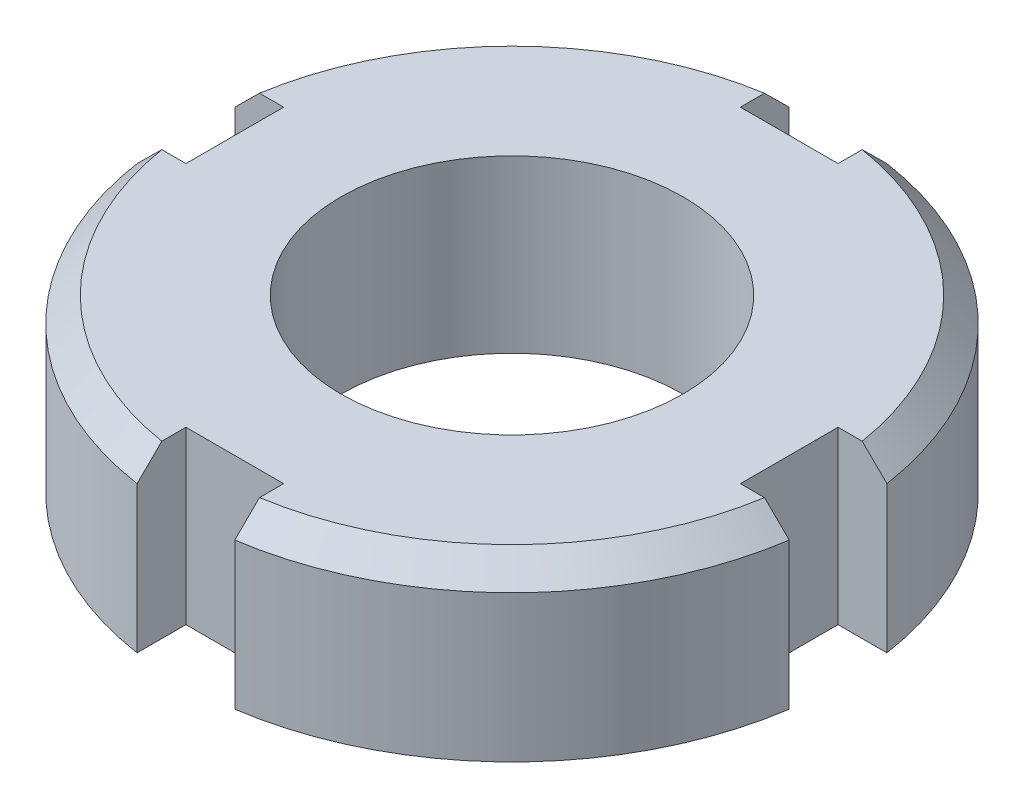
ISO-10303-21;
HEADER;
FILE_DESCRIPTION(('STEP AP214'),'2;1');
FILE_NAME('part.step','',(''),(''),'','','');
FILE_SCHEMA(('AUTOMOTIVE_DESIGN { 1 0 10303 214 1 1 1 1 }'));
ENDSEC;
DATA;
#1=APPLICATION_CONTEXT('core data for automotive mechanical design processes');
#2=APPLICATION_PROTOCOL_DEFINITION('international standard','automotive_design',2000,#1);
#3=PRODUCT_CONTEXT('',#1,'mechanical');
#4=PRODUCT('Part','Part','',(#3));
#5=PRODUCT_RELATED_PRODUCT_CATEGORY('part','',(#4));
#6=PRODUCT_DEFINITION_FORMATION('','',#4);
#7=PRODUCT_DEFINITION_CONTEXT('part definition',#1,'design');
#8=PRODUCT_DEFINITION('design','',#6,#7);
#9=PRODUCT_DEFINITION_SHAPE('','',#8);
#10=(LENGTH_UNIT() NAMED_UNIT(*) SI_UNIT(.MILLI.,.METRE.));
#11=(NAMED_UNIT(*) PLANE_ANGLE_UNIT() SI_UNIT($,.RADIAN.));
#12=(NAMED_UNIT(*) SI_UNIT($,.STERADIAN.) SOLID_ANGLE_UNIT());
#13=UNCERTAINTY_MEASURE_WITH_UNIT(LENGTH_MEASURE(1.E-05),#10,'distance_accuracy_value','');
#14=(GEOMETRIC_REPRESENTATION_CONTEXT(3) GLOBAL_UNCERTAINTY_ASSIGNED_CONTEXT((#13)) GLOBAL_UNIT_ASSIGNED_CONTEXT((#10,
#11,#12)) REPRESENTATION_CONTEXT('',''));
#15=CARTESIAN_POINT('',(0.,0.,0.));
#16=DIRECTION('',(0.,0.,1.));
#17=DIRECTION('',(1.,0.,0.));
#18=AXIS2_PLACEMENT_3D('',#15,#16,#17);
#19=CARTESIAN_POINT('',(0.,3.5,0.));
#20=DIRECTION('',(0.,-1.,0.));
#21=DIRECTION('',(0.,0.,-1.));
#22=AXIS2_PLACEMENT_3D('',#19,#20,#21);
#23=CYLINDRICAL_SURFACE('',#22,13.5);
#24=DIRECTION('',(0.,1.,0.));
#25=VECTOR('',#24,1.);
#26=CARTESIAN_POINT('',(2.,-3.5,-13.3510299228187));
#27=LINE('',#26,#25);
#28=CARTESIAN_POINT('',(2.,-3.5,-13.3510299228187));
#29=VERTEX_POINT('',#28);
#30=CARTESIAN_POINT('',(2.,2.5,-13.3510299228187));
#31=VERTEX_POINT('',#30);
#32=EDGE_CURVE('E223',#29,#31,#27,.T.);
#33=ORIENTED_EDGE('',*,*,#32,.T.);
#34=CARTESIAN_POINT('',(0.,2.5,0.));
#35=DIRECTION('',(0.,1.,0.));
#36=DIRECTION('',(0.,0.,1.));
#37=AXIS2_PLACEMENT_3D('',#34,#35,#36);
#38=CIRCLE('',#37,13.5);
#39=CARTESIAN_POINT('',(13.3510299228187,2.5,-1.99999999999996));
#40=VERTEX_POINT('',#39);
#41=EDGE_CURVE('E369',#31,#40,#38,.F.);
#42=ORIENTED_EDGE('',*,*,#41,.T.);
#43=DIRECTION('',(0.,1.,0.));
#44=VECTOR('',#43,1.);
#45=CARTESIAN_POINT('',(13.3510299228187,-3.5,-1.99999999999996));
#46=LINE('',#45,#44);
#47=CARTESIAN_POINT('',(13.3510299228187,-3.5,-1.99999999999996));
#48=VERTEX_POINT('',#47);
#49=EDGE_CURVE('E229',#48,#40,#46,.T.);
#50=ORIENTED_EDGE('',*,*,#49,.F.);
#51=CARTESIAN_POINT('',(0.,-3.5,0.));
#52=DIRECTION('',(0.,1.,0.));
#53=DIRECTION('',(0.,0.,1.));
#54=AXIS2_PLACEMENT_3D('',#51,#52,#53);
#55=CIRCLE('',#54,13.5);
#56=EDGE_CURVE('E314',#48,#29,#55,.T.);
#57=ORIENTED_EDGE('',*,*,#56,.T.);
#58=EDGE_LOOP('',(#33,#42,#50,#57));
#59=FACE_BOUND('',#58,.T.);
#60=ADVANCED_FACE('F42',(#59),#23,.T.);
#61=DIRECTION('',(0.,1.,0.));
#62=VECTOR('',#61,1.);
#63=CARTESIAN_POINT('',(13.3510299228187,-3.5,2.00000000000005));
#64=LINE('',#63,#62);
#65=CARTESIAN_POINT('',(13.3510299228187,-3.5,2.00000000000005));
#66=VERTEX_POINT('',#65);
#67=CARTESIAN_POINT('',(13.3510299228187,2.5,2.00000000000005));
#68=VERTEX_POINT('',#67);
#69=EDGE_CURVE('E238',#66,#68,#64,.T.);
#70=ORIENTED_EDGE('',*,*,#69,.T.);
#71=CARTESIAN_POINT('',(0.,2.5,0.));
#72=DIRECTION('',(0.,1.,0.));
#73=DIRECTION('',(0.,0.,1.));
#74=AXIS2_PLACEMENT_3D('',#71,#72,#73);
#75=CIRCLE('',#74,13.5);
#76=CARTESIAN_POINT('',(1.99999999999991,2.5,13.3510299228187));
#77=VERTEX_POINT('',#76);
#78=EDGE_CURVE('E433',#68,#77,#75,.F.);
#79=ORIENTED_EDGE('',*,*,#78,.T.);
#80=DIRECTION('',(0.,1.,0.));
#81=VECTOR('',#80,1.);
#82=CARTESIAN_POINT('',(1.99999999999991,-3.5,13.3510299228187));
#83=LINE('',#82,#81);
#84=CARTESIAN_POINT('',(1.99999999999991,-3.5,13.3510299228187));
#85=VERTEX_POINT('',#84);
#86=EDGE_CURVE('E257',#85,#77,#83,.T.);
#87=ORIENTED_EDGE('',*,*,#86,.F.);
#88=EDGE_CURVE('E310',#85,#66,#55,.T.);
#89=ORIENTED_EDGE('',*,*,#88,.T.);
#90=EDGE_LOOP('',(#70,#79,#87,#89));
#91=FACE_BOUND('',#90,.T.);
#92=ADVANCED_FACE('F359',(#91),#23,.T.);
#93=DIRECTION('',(0.,1.,0.));
#94=VECTOR('',#93,1.);
#95=CARTESIAN_POINT('',(-2.0000000000001,-3.5,13.3510299228187));
#96=LINE('',#95,#94);
#97=CARTESIAN_POINT('',(-2.0000000000001,-3.5,13.3510299228187));
#98=VERTEX_POINT('',#97);
#99=CARTESIAN_POINT('',(-2.0000000000001,2.5,13.3510299228187));
#100=VERTEX_POINT('',#99);
#101=EDGE_CURVE('E266',#98,#100,#96,.T.);
#102=ORIENTED_EDGE('',*,*,#101,.T.);
#103=CARTESIAN_POINT('',(0.,2.5,0.));
#104=DIRECTION('',(0.,1.,0.));
#105=DIRECTION('',(0.,0.,1.));
#106=AXIS2_PLACEMENT_3D('',#103,#104,#105);
#107=CIRCLE('',#106,13.5);
#108=CARTESIAN_POINT('',(-13.3510299228187,2.5,1.99999999999986));
#109=VERTEX_POINT('',#108);
#110=EDGE_CURVE('E57',#100,#109,#107,.F.);
#111=ORIENTED_EDGE('',*,*,#110,.T.);
#112=DIRECTION('',(0.,1.,0.));
#113=VECTOR('',#112,1.);
#114=CARTESIAN_POINT('',(-13.3510299228187,-3.5,1.99999999999986));
#115=LINE('',#114,#113);
#116=CARTESIAN_POINT('',(-13.3510299228187,-3.5,1.99999999999986));
#117=VERTEX_POINT('',#116);
#118=EDGE_CURVE('E283',#117,#109,#115,.T.);
#119=ORIENTED_EDGE('',*,*,#118,.F.);
#120=EDGE_CURVE('E226',#117,#98,#55,.T.);
#121=ORIENTED_EDGE('',*,*,#120,.T.);
#122=EDGE_LOOP('',(#102,#111,#119,#121));
#123=FACE_BOUND('',#122,.T.);
#124=ADVANCED_FACE('F354',(#123),#23,.T.);
#125=DIRECTION('',(0.,1.,0.));
#126=VECTOR('',#125,1.);
#127=CARTESIAN_POINT('',(-13.3510299228187,-3.5,-2.00000000000014));
#128=LINE('',#127,#126);
#129=CARTESIAN_POINT('',(-13.3510299228187,-3.5,-2.00000000000014));
#130=VERTEX_POINT('',#129);
#131=CARTESIAN_POINT('',(-13.3510299228187,2.5,-2.00000000000014));
#132=VERTEX_POINT('',#131);
#133=EDGE_CURVE('E291',#130,#132,#128,.T.);
#134=ORIENTED_EDGE('',*,*,#133,.T.);
#135=CARTESIAN_POINT('',(0.,2.5,0.));
#136=DIRECTION('',(0.,1.,0.));
#137=DIRECTION('',(0.,0.,1.));
#138=AXIS2_PLACEMENT_3D('',#135,#136,#137);
#139=CIRCLE('',#138,13.5);
#140=CARTESIAN_POINT('',(-2.,2.5,-13.3510299228187));
#141=VERTEX_POINT('',#140);
#142=EDGE_CURVE('E332',#132,#141,#139,.F.);
#143=ORIENTED_EDGE('',*,*,#142,.T.);
#144=DIRECTION('',(0.,1.,0.));
#145=VECTOR('',#144,1.);
#146=CARTESIAN_POINT('',(-2.,-3.5,-13.3510299228187));
#147=LINE('',#146,#145);
#148=CARTESIAN_POINT('',(-2.,-3.5,-13.3510299228187));
#149=VERTEX_POINT('',#148);
#150=EDGE_CURVE('E207',#149,#141,#147,.T.);
#151=ORIENTED_EDGE('',*,*,#150,.F.);
#152=EDGE_CURVE('E469',#149,#130,#55,.T.);
#153=ORIENTED_EDGE('',*,*,#152,.T.);
#154=EDGE_LOOP('',(#134,#143,#151,#153));
#155=FACE_BOUND('',#154,.T.);
#156=ADVANCED_FACE('F349',(#155),#23,.T.);
#157=CARTESIAN_POINT('',(0.,3.5,0.));
#158=DIRECTION('',(0.,1.,0.));
#159=DIRECTION('',(0.,0.,1.));
#160=AXIS2_PLACEMENT_3D('',#157,#158,#159);
#161=PLANE('',#160);
#162=CARTESIAN_POINT('',(0.,3.5,0.));
#163=DIRECTION('',(0.,1.,0.));
#164=DIRECTION('',(0.,0.,1.));
#165=AXIS2_PLACEMENT_3D('',#162,#163,#164);
#166=CIRCLE('',#165,7.);
#167=CARTESIAN_POINT('',(0.,3.5,7.));
#168=VERTEX_POINT('',#167);
#169=EDGE_CURVE('E523',#168,#168,#166,.T.);
#170=ORIENTED_EDGE('',*,*,#169,.F.);
#171=EDGE_LOOP('',(#170));
#172=FACE_BOUND('',#171,.T.);
#173=DIRECTION('',(0.,0.,1.));
#174=VECTOR('',#173,1.);
#175=CARTESIAN_POINT('',(-2.,3.5,-13.3510299228187));
#176=LINE('',#175,#174);
#177=CARTESIAN_POINT('',(-2.,3.5,-12.3389626792531));
#178=VERTEX_POINT('',#177);
#179=CARTESIAN_POINT('',(-2.,3.5,-11.3510299228187));
#180=VERTEX_POINT('',#179);
#181=EDGE_CURVE('E185',#178,#180,#176,.T.);
#182=ORIENTED_EDGE('',*,*,#181,.F.);
#183=CARTESIAN_POINT('',(0.,3.5,0.));
#184=DIRECTION('',(0.,1.,0.));
#185=DIRECTION('',(0.,0.,1.));
#186=AXIS2_PLACEMENT_3D('',#183,#184,#185);
#187=CIRCLE('',#186,12.5);
#188=CARTESIAN_POINT('',(-12.338962679253,3.5,-2.00000000000014));
#189=VERTEX_POINT('',#188);
#190=EDGE_CURVE('E322',#178,#189,#187,.T.);
#191=ORIENTED_EDGE('',*,*,#190,.T.);
#192=DIRECTION('',(-1.,0.,0.));
#193=VECTOR('',#192,1.);
#194=CARTESIAN_POINT('',(-11.3510299228187,3.5,-2.00000000000013));
#195=LINE('',#194,#193);
#196=CARTESIAN_POINT('',(-11.3510299228187,3.5,-2.00000000000013));
#197=VERTEX_POINT('',#196);
#198=EDGE_CURVE('E303',#197,#189,#195,.T.);
#199=ORIENTED_EDGE('',*,*,#198,.F.);
#200=DIRECTION('',(0.,0.,-1.));
#201=VECTOR('',#200,1.);
#202=CARTESIAN_POINT('',(-11.3510299228187,3.5,1.99999999999988));
#203=LINE('',#202,#201);
#204=CARTESIAN_POINT('',(-11.3510299228187,3.5,1.99999999999988));
#205=VERTEX_POINT('',#204);
#206=EDGE_CURVE('E306',#205,#197,#203,.T.);
#207=ORIENTED_EDGE('',*,*,#206,.F.);
#208=DIRECTION('',(1.,0.,0.));
#209=VECTOR('',#208,1.);
#210=CARTESIAN_POINT('',(-13.3510299228187,3.5,1.99999999999986));
#211=LINE('',#210,#209);
#212=CARTESIAN_POINT('',(-12.3389626792531,3.5,1.99999999999987));
#213=VERTEX_POINT('',#212);
#214=EDGE_CURVE('E268',#213,#205,#211,.T.);
#215=ORIENTED_EDGE('',*,*,#214,.F.);
#216=CARTESIAN_POINT('',(0.,3.5,0.));
#217=DIRECTION('',(0.,1.,0.));
#218=DIRECTION('',(0.,0.,1.));
#219=AXIS2_PLACEMENT_3D('',#216,#217,#218);
#220=CIRCLE('',#219,12.5);
#221=CARTESIAN_POINT('',(-2.00000000000009,3.5,12.3389626792531));
#222=VERTEX_POINT('',#221);
#223=EDGE_CURVE('E313',#213,#222,#220,.T.);
#224=ORIENTED_EDGE('',*,*,#223,.T.);
#225=DIRECTION('',(0.,0.,1.));
#226=VECTOR('',#225,1.);
#227=CARTESIAN_POINT('',(-2.00000000000009,3.5,11.3510299228187));
#228=LINE('',#227,#226);
#229=CARTESIAN_POINT('',(-2.00000000000009,3.5,11.3510299228187));
#230=VERTEX_POINT('',#229);
#231=EDGE_CURVE('E277',#230,#222,#228,.T.);
#232=ORIENTED_EDGE('',*,*,#231,.F.);
#233=DIRECTION('',(-1.,0.,0.));
#234=VECTOR('',#233,1.);
#235=CARTESIAN_POINT('',(1.99999999999992,3.5,11.3510299228187));
#236=LINE('',#235,#234);
#237=CARTESIAN_POINT('',(1.99999999999992,3.5,11.3510299228187));
#238=VERTEX_POINT('',#237);
#239=EDGE_CURVE('E279',#238,#230,#236,.T.);
#240=ORIENTED_EDGE('',*,*,#239,.F.);
#241=DIRECTION('',(0.,0.,-1.));
#242=VECTOR('',#241,1.);
#243=CARTESIAN_POINT('',(1.99999999999991,3.5,13.3510299228187));
#244=LINE('',#243,#242);
#245=CARTESIAN_POINT('',(1.99999999999992,3.5,12.3389626792531));
#246=VERTEX_POINT('',#245);
#247=EDGE_CURVE('E241',#246,#238,#244,.T.);
#248=ORIENTED_EDGE('',*,*,#247,.F.);
#249=CARTESIAN_POINT('',(0.,3.5,0.));
#250=DIRECTION('',(0.,1.,0.));
#251=DIRECTION('',(0.,0.,1.));
#252=AXIS2_PLACEMENT_3D('',#249,#250,#251);
#253=CIRCLE('',#252,12.5);
#254=CARTESIAN_POINT('',(12.3389626792531,3.5,2.00000000000005));
#255=VERTEX_POINT('',#254);
#256=EDGE_CURVE('E317',#246,#255,#253,.T.);
#257=ORIENTED_EDGE('',*,*,#256,.T.);
#258=DIRECTION('',(1.,0.,0.));
#259=VECTOR('',#258,1.);
#260=CARTESIAN_POINT('',(11.3510299228187,3.5,2.00000000000005));
#261=LINE('',#260,#259);
#262=CARTESIAN_POINT('',(11.3510299228187,3.5,2.00000000000005));
#263=VERTEX_POINT('',#262);
#264=EDGE_CURVE('E250',#263,#255,#261,.T.);
#265=ORIENTED_EDGE('',*,*,#264,.F.);
#266=DIRECTION('',(0.,0.,1.));
#267=VECTOR('',#266,1.);
#268=CARTESIAN_POINT('',(11.3510299228187,3.5,-1.99999999999996));
#269=LINE('',#268,#267);
#270=CARTESIAN_POINT('',(11.3510299228187,3.5,-1.99999999999996));
#271=VERTEX_POINT('',#270);
#272=EDGE_CURVE('E253',#271,#263,#269,.T.);
#273=ORIENTED_EDGE('',*,*,#272,.F.);
#274=DIRECTION('',(-1.,0.,0.));
#275=VECTOR('',#274,1.);
#276=CARTESIAN_POINT('',(13.3510299228187,3.5,-1.99999999999996));
#277=LINE('',#276,#275);
#278=CARTESIAN_POINT('',(12.3389626792531,3.5,-1.99999999999996));
#279=VERTEX_POINT('',#278);
#280=EDGE_CURVE('E198',#279,#271,#277,.T.);
#281=ORIENTED_EDGE('',*,*,#280,.F.);
#282=CARTESIAN_POINT('',(0.,3.5,0.));
#283=DIRECTION('',(0.,1.,0.));
#284=DIRECTION('',(0.,0.,1.));
#285=AXIS2_PLACEMENT_3D('',#282,#283,#284);
#286=CIRCLE('',#285,12.5);
#287=CARTESIAN_POINT('',(2.00000000000001,3.5,-12.3389626792531));
#288=VERTEX_POINT('',#287);
#289=EDGE_CURVE('E320',#279,#288,#286,.T.);
#290=ORIENTED_EDGE('',*,*,#289,.T.);
#291=DIRECTION('',(0.,0.,-1.));
#292=VECTOR('',#291,1.);
#293=CARTESIAN_POINT('',(2.00000000000001,3.5,-11.3510299228187));
#294=LINE('',#293,#292);
#295=CARTESIAN_POINT('',(2.00000000000001,3.5,-11.3510299228187));
#296=VERTEX_POINT('',#295);
#297=EDGE_CURVE('E212',#296,#288,#294,.T.);
#298=ORIENTED_EDGE('',*,*,#297,.F.);
#299=DIRECTION('',(1.,0.,0.));
#300=VECTOR('',#299,1.);
#301=CARTESIAN_POINT('',(-2.,3.5,-11.3510299228187));
#302=LINE('',#301,#300);
#303=EDGE_CURVE('E197',#180,#296,#302,.T.);
#304=ORIENTED_EDGE('',*,*,#303,.F.);
#305=EDGE_LOOP('',(#182,#191,#199,#207,#215,#224,#232,#240,#248,#257,#265,#273,#281,#290,#298,#304));
#306=FACE_BOUND('',#305,.T.);
#307=ADVANCED_FACE('F209',(#172,#306),#161,.T.);
#308=CARTESIAN_POINT('',(0.,-3.5,0.));
#309=DIRECTION('',(0.,1.,0.));
#310=DIRECTION('',(0.,0.,1.));
#311=AXIS2_PLACEMENT_3D('',#308,#309,#310);
#312=PLANE('',#311);
#313=CARTESIAN_POINT('',(0.,-3.5,0.));
#314=DIRECTION('',(0.,1.,0.));
#315=DIRECTION('',(0.,0.,1.));
#316=AXIS2_PLACEMENT_3D('',#313,#314,#315);
#317=CIRCLE('',#316,7.);
#318=CARTESIAN_POINT('',(0.,-3.5,7.));
#319=VERTEX_POINT('',#318);
#320=EDGE_CURVE('E294',#319,#319,#317,.T.);
#321=ORIENTED_EDGE('',*,*,#320,.T.);
#322=EDGE_LOOP('',(#321));
#323=FACE_BOUND('',#322,.T.);
#324=DIRECTION('',(1.,0.,0.));
#325=VECTOR('',#324,1.);
#326=CARTESIAN_POINT('',(-2.,-3.5,-11.3510299228187));
#327=LINE('',#326,#325);
#328=CARTESIAN_POINT('',(-2.,-3.5,-11.3510299228187));
#329=VERTEX_POINT('',#328);
#330=CARTESIAN_POINT('',(2.00000000000001,-3.5,-11.3510299228187));
#331=VERTEX_POINT('',#330);
#332=EDGE_CURVE('E205',#329,#331,#327,.T.);
#333=ORIENTED_EDGE('',*,*,#332,.T.);
#334=DIRECTION('',(0.,0.,-1.));
#335=VECTOR('',#334,1.);
#336=CARTESIAN_POINT('',(2.00000000000001,-3.5,-11.3510299228187));
#337=LINE('',#336,#335);
#338=EDGE_CURVE('E220',#331,#29,#337,.T.);
#339=ORIENTED_EDGE('',*,*,#338,.T.);
#340=ORIENTED_EDGE('',*,*,#56,.F.);
#341=DIRECTION('',(-1.,0.,0.));
#342=VECTOR('',#341,1.);
#343=CARTESIAN_POINT('',(13.3510299228187,-3.5,-1.99999999999996));
#344=LINE('',#343,#342);
#345=CARTESIAN_POINT('',(11.3510299228187,-3.5,-1.99999999999996));
#346=VERTEX_POINT('',#345);
#347=EDGE_CURVE('E247',#48,#346,#344,.T.);
#348=ORIENTED_EDGE('',*,*,#347,.T.);
#349=DIRECTION('',(0.,0.,1.));
#350=VECTOR('',#349,1.);
#351=CARTESIAN_POINT('',(11.3510299228187,-3.5,-1.99999999999996));
#352=LINE('',#351,#350);
#353=CARTESIAN_POINT('',(11.3510299228187,-3.5,2.00000000000005));
#354=VERTEX_POINT('',#353);
#355=EDGE_CURVE('E244',#346,#354,#352,.T.);
#356=ORIENTED_EDGE('',*,*,#355,.T.);
#357=DIRECTION('',(1.,0.,0.));
#358=VECTOR('',#357,1.);
#359=CARTESIAN_POINT('',(11.3510299228187,-3.5,2.00000000000005));
#360=LINE('',#359,#358);
#361=EDGE_CURVE('E232',#354,#66,#360,.T.);
#362=ORIENTED_EDGE('',*,*,#361,.T.);
#363=ORIENTED_EDGE('',*,*,#88,.F.);
#364=DIRECTION('',(0.,0.,-1.));
#365=VECTOR('',#364,1.);
#366=CARTESIAN_POINT('',(1.99999999999991,-3.5,13.3510299228187));
#367=LINE('',#366,#365);
#368=CARTESIAN_POINT('',(1.99999999999992,-3.5,11.3510299228187));
#369=VERTEX_POINT('',#368);
#370=EDGE_CURVE('E274',#85,#369,#367,.T.);
#371=ORIENTED_EDGE('',*,*,#370,.T.);
#372=DIRECTION('',(-1.,0.,0.));
#373=VECTOR('',#372,1.);
#374=CARTESIAN_POINT('',(1.99999999999992,-3.5,11.3510299228187));
#375=LINE('',#374,#373);
#376=CARTESIAN_POINT('',(-2.00000000000009,-3.5,11.3510299228187));
#377=VERTEX_POINT('',#376);
#378=EDGE_CURVE('E271',#369,#377,#375,.T.);
#379=ORIENTED_EDGE('',*,*,#378,.T.);
#380=DIRECTION('',(0.,0.,1.));
#381=VECTOR('',#380,1.);
#382=CARTESIAN_POINT('',(-2.00000000000009,-3.5,11.3510299228187));
#383=LINE('',#382,#381);
#384=EDGE_CURVE('E260',#377,#98,#383,.T.);
#385=ORIENTED_EDGE('',*,*,#384,.T.);
#386=ORIENTED_EDGE('',*,*,#120,.F.);
#387=DIRECTION('',(1.,0.,0.));
#388=VECTOR('',#387,1.);
#389=CARTESIAN_POINT('',(-13.3510299228187,-3.5,1.99999999999986));
#390=LINE('',#389,#388);
#391=CARTESIAN_POINT('',(-11.3510299228187,-3.5,1.99999999999988));
#392=VERTEX_POINT('',#391);
#393=EDGE_CURVE('E300',#117,#392,#390,.T.);
#394=ORIENTED_EDGE('',*,*,#393,.T.);
#395=DIRECTION('',(0.,0.,-1.));
#396=VECTOR('',#395,1.);
#397=CARTESIAN_POINT('',(-11.3510299228187,-3.5,1.99999999999988));
#398=LINE('',#397,#396);
#399=CARTESIAN_POINT('',(-11.3510299228187,-3.5,-2.00000000000013));
#400=VERTEX_POINT('',#399);
#401=EDGE_CURVE('E297',#392,#400,#398,.T.);
#402=ORIENTED_EDGE('',*,*,#401,.T.);
#403=DIRECTION('',(-1.,0.,0.));
#404=VECTOR('',#403,1.);
#405=CARTESIAN_POINT('',(-11.3510299228187,-3.5,-2.00000000000013));
#406=LINE('',#405,#404);
#407=EDGE_CURVE('E285',#400,#130,#406,.T.);
#408=ORIENTED_EDGE('',*,*,#407,.T.);
#409=ORIENTED_EDGE('',*,*,#152,.F.);
#410=DIRECTION('',(0.,0.,1.));
#411=VECTOR('',#410,1.);
#412=CARTESIAN_POINT('',(-2.,-3.5,-13.3510299228187));
#413=LINE('',#412,#411);
#414=EDGE_CURVE('E214',#149,#329,#413,.T.);
#415=ORIENTED_EDGE('',*,*,#414,.T.);
#416=EDGE_LOOP('',(#333,#339,#340,#348,#356,#362,#363,#371,#379,#385,#386,#394,#402,#408,#409,#415));
#417=FACE_BOUND('',#416,.T.);
#418=ADVANCED_FACE('F345',(#323,#417),#312,.F.);
#419=CARTESIAN_POINT('',(-11.3510299228187,-3.5,-2.00000000000013));
#420=DIRECTION('',(0.,0.,-1.));
#421=DIRECTION('',(-1.,0.,0.));
#422=AXIS2_PLACEMENT_3D('',#419,#420,#421);
#423=PLANE('',#422);
#424=ORIENTED_EDGE('',*,*,#198,.T.);
#425=CARTESIAN_POINT('',(-12.338962679253,3.5,-2.00000000000014));
#426=CARTESIAN_POINT('',(-12.5077183687956,3.33341208726108,-2.00000000000014));
#427=CARTESIAN_POINT('',(-12.6764351507074,3.16678479738353,-2.00000000000014));
#428=CARTESIAN_POINT('',(-13.0137908985622,2.83345146404987,-2.00000000000014));
#429=CARTESIAN_POINT('',(-13.1824298645057,2.66674542059408,-2.00000000000014));
#430=CARTESIAN_POINT('',(-13.3510299228187,2.5,-2.00000000000014));
#431=B_SPLINE_CURVE_WITH_KNOTS('',3,(#425,#426,#427,#428,#429,#430),.UNSPECIFIED.,.F.,.F.,(4,2,
4),(0.,0.711386010598613,1.42277201821499),.UNSPECIFIED.);
#432=EDGE_CURVE('E324',#189,#132,#431,.T.);
#433=ORIENTED_EDGE('',*,*,#432,.T.);
#434=ORIENTED_EDGE('',*,*,#133,.F.);
#435=ORIENTED_EDGE('',*,*,#407,.F.);
#436=DIRECTION('',(0.,1.,0.));
#437=VECTOR('',#436,1.);
#438=CARTESIAN_POINT('',(-11.3510299228187,-3.5,-2.00000000000013));
#439=LINE('',#438,#437);
#440=EDGE_CURVE('E289',#400,#197,#439,.T.);
#441=ORIENTED_EDGE('',*,*,#440,.T.);
#442=EDGE_LOOP('',(#424,#433,#434,#435,#441));
#443=FACE_BOUND('',#442,.T.);
#444=ADVANCED_FACE('F339',(#443),#423,.F.);
#445=CARTESIAN_POINT('',(-11.3510299228187,-3.5,1.99999999999988));
#446=DIRECTION('',(1.,0.,0.));
#447=DIRECTION('',(0.,0.,-1.));
#448=AXIS2_PLACEMENT_3D('',#445,#446,#447);
#449=PLANE('',#448);
#450=ORIENTED_EDGE('',*,*,#440,.F.);
#451=ORIENTED_EDGE('',*,*,#401,.F.);
#452=DIRECTION('',(0.,1.,0.));
#453=VECTOR('',#452,1.);
#454=CARTESIAN_POINT('',(-11.3510299228187,-3.5,1.99999999999988));
#455=LINE('',#454,#453);
#456=EDGE_CURVE('E286',#392,#205,#455,.T.);
#457=ORIENTED_EDGE('',*,*,#456,.T.);
#458=ORIENTED_EDGE('',*,*,#206,.T.);
#459=EDGE_LOOP('',(#450,#451,#457,#458));
#460=FACE_BOUND('',#459,.T.);
#461=ADVANCED_FACE('F344',(#460),#449,.F.);
#462=CARTESIAN_POINT('',(-13.3510299228187,-3.5,1.99999999999986));
#463=DIRECTION('',(0.,0.,1.));
#464=DIRECTION('',(1.,0.,0.));
#465=AXIS2_PLACEMENT_3D('',#462,#463,#464);
#466=PLANE('',#465);
#467=ORIENTED_EDGE('',*,*,#118,.T.);
#468=CARTESIAN_POINT('',(-13.3510299228187,2.5,1.99999999999986));
#469=CARTESIAN_POINT('',(-13.1824298645057,2.66674542059408,1.99999999999987));
#470=CARTESIAN_POINT('',(-13.0137908985623,2.83345146404986,1.99999999999987));
#471=CARTESIAN_POINT('',(-12.6764351507074,3.16678479738353,1.99999999999987));
#472=CARTESIAN_POINT('',(-12.5077183687956,3.33341208726108,1.99999999999987));
#473=CARTESIAN_POINT('',(-12.3389626792531,3.5,1.99999999999987));
#474=B_SPLINE_CURVE_WITH_KNOTS('',3,(#468,#469,#470,#471,#472,#473),.UNSPECIFIED.,.F.,.F.,(4,2,
4),(0.,0.711386007616383,1.422772018215),.UNSPECIFIED.);
#475=EDGE_CURVE('E11',#109,#213,#474,.T.);
#476=ORIENTED_EDGE('',*,*,#475,.T.);
#477=ORIENTED_EDGE('',*,*,#214,.T.);
#478=ORIENTED_EDGE('',*,*,#456,.F.);
#479=ORIENTED_EDGE('',*,*,#393,.F.);
#480=EDGE_LOOP('',(#467,#476,#477,#478,#479));
#481=FACE_BOUND('',#480,.T.);
#482=ADVANCED_FACE('F477',(#481),#466,.F.);
#483=CARTESIAN_POINT('',(-2.00000000000009,-3.5,11.3510299228187));
#484=DIRECTION('',(-1.,0.,0.));
#485=DIRECTION('',(0.,0.,1.));
#486=AXIS2_PLACEMENT_3D('',#483,#484,#485);
#487=PLANE('',#486);
#488=ORIENTED_EDGE('',*,*,#231,.T.);
#489=CARTESIAN_POINT('',(-2.00000000000009,3.5,12.3389626792531));
#490=CARTESIAN_POINT('',(-2.00000000000009,3.33341208726108,12.5077183687956));
#491=CARTESIAN_POINT('',(-2.00000000000009,3.16678479738353,12.6764351507074));
#492=CARTESIAN_POINT('',(-2.00000000000009,2.83345146404986,13.0137908985622));
#493=CARTESIAN_POINT('',(-2.0000000000001,2.66674542059408,13.1824298645057));
#494=CARTESIAN_POINT('',(-2.0000000000001,2.5,13.3510299228187));
#495=B_SPLINE_CURVE_WITH_KNOTS('',3,(#489,#490,#491,#492,#493,#494),.UNSPECIFIED.,.F.,.F.,(4,2,
4),(0.,0.711386010598618,1.422772018215),.UNSPECIFIED.);
#496=EDGE_CURVE('E71',#222,#100,#495,.T.);
#497=ORIENTED_EDGE('',*,*,#496,.T.);
#498=ORIENTED_EDGE('',*,*,#101,.F.);
#499=ORIENTED_EDGE('',*,*,#384,.F.);
#500=DIRECTION('',(0.,1.,0.));
#501=VECTOR('',#500,1.);
#502=CARTESIAN_POINT('',(-2.00000000000009,-3.5,11.3510299228187));
#503=LINE('',#502,#501);
#504=EDGE_CURVE('E264',#377,#230,#503,.T.);
#505=ORIENTED_EDGE('',*,*,#504,.T.);
#506=EDGE_LOOP('',(#488,#497,#498,#499,#505));
#507=FACE_BOUND('',#506,.T.);
#508=ADVANCED_FACE('F475',(#507),#487,.F.);
#509=CARTESIAN_POINT('',(1.99999999999992,-3.5,11.3510299228187));
#510=DIRECTION('',(0.,0.,-1.));
#511=DIRECTION('',(-1.,0.,0.));
#512=AXIS2_PLACEMENT_3D('',#509,#510,#511);
#513=PLANE('',#512);
#514=ORIENTED_EDGE('',*,*,#504,.F.);
#515=ORIENTED_EDGE('',*,*,#378,.F.);
#516=DIRECTION('',(0.,1.,0.));
#517=VECTOR('',#516,1.);
#518=CARTESIAN_POINT('',(1.99999999999992,-3.5,11.3510299228187));
#519=LINE('',#518,#517);
#520=EDGE_CURVE('E261',#369,#238,#519,.T.);
#521=ORIENTED_EDGE('',*,*,#520,.T.);
#522=ORIENTED_EDGE('',*,*,#239,.T.);
#523=EDGE_LOOP('',(#514,#515,#521,#522));
#524=FACE_BOUND('',#523,.T.);
#525=ADVANCED_FACE('F423',(#524),#513,.F.);
#526=CARTESIAN_POINT('',(1.99999999999991,-3.5,13.3510299228187));
#527=DIRECTION('',(1.,0.,0.));
#528=DIRECTION('',(0.,0.,-1.));
#529=AXIS2_PLACEMENT_3D('',#526,#527,#528);
#530=PLANE('',#529);
#531=ORIENTED_EDGE('',*,*,#86,.T.);
#532=CARTESIAN_POINT('',(1.99999999999991,2.5,13.3510299228187));
#533=CARTESIAN_POINT('',(1.99999999999991,2.66674542059408,13.1824298645057));
#534=CARTESIAN_POINT('',(1.99999999999991,2.83345146404986,13.0137908985623));
#535=CARTESIAN_POINT('',(1.99999999999991,3.16678479738353,12.6764351507074));
#536=CARTESIAN_POINT('',(1.99999999999991,3.33341208726108,12.5077183687956));
#537=CARTESIAN_POINT('',(1.99999999999992,3.5,12.3389626792531));
#538=B_SPLINE_CURVE_WITH_KNOTS('',3,(#532,#533,#534,#535,#536,#537),.UNSPECIFIED.,.F.,.F.,(4,2,
4),(0.,0.711386007616378,1.42277201821499),.UNSPECIFIED.);
#539=EDGE_CURVE('E427',#77,#246,#538,.T.);
#540=ORIENTED_EDGE('',*,*,#539,.T.);
#541=ORIENTED_EDGE('',*,*,#247,.T.);
#542=ORIENTED_EDGE('',*,*,#520,.F.);
#543=ORIENTED_EDGE('',*,*,#370,.F.);
#544=EDGE_LOOP('',(#531,#540,#541,#542,#543));
#545=FACE_BOUND('',#544,.T.);
#546=ADVANCED_FACE('F418',(#545),#530,.F.);
#547=CARTESIAN_POINT('',(11.3510299228187,-3.5,2.00000000000005));
#548=DIRECTION('',(0.,0.,1.));
#549=DIRECTION('',(1.,0.,0.));
#550=AXIS2_PLACEMENT_3D('',#547,#548,#549);
#551=PLANE('',#550);
#552=ORIENTED_EDGE('',*,*,#264,.T.);
#553=CARTESIAN_POINT('',(12.3389626792531,3.5,2.00000000000005));
#554=CARTESIAN_POINT('',(12.5077183687956,3.33341208726108,2.00000000000005));
#555=CARTESIAN_POINT('',(12.6764351507074,3.16678479738353,2.00000000000005));
#556=CARTESIAN_POINT('',(13.0137908985623,2.83345146404986,2.00000000000005));
#557=CARTESIAN_POINT('',(13.1824298645057,2.66674542059408,2.00000000000005));
#558=CARTESIAN_POINT('',(13.3510299228187,2.5,2.00000000000005));
#559=B_SPLINE_CURVE_WITH_KNOTS('',3,(#553,#554,#555,#556,#557,#558),.UNSPECIFIED.,.F.,.F.,(4,2,
4),(0.,0.711386010598612,1.42277201821499),.UNSPECIFIED.);
#560=EDGE_CURVE('E380',#255,#68,#559,.T.);
#561=ORIENTED_EDGE('',*,*,#560,.T.);
#562=ORIENTED_EDGE('',*,*,#69,.F.);
#563=ORIENTED_EDGE('',*,*,#361,.F.);
#564=DIRECTION('',(0.,1.,0.));
#565=VECTOR('',#564,1.);
#566=CARTESIAN_POINT('',(11.3510299228187,-3.5,2.00000000000005));
#567=LINE('',#566,#565);
#568=EDGE_CURVE('E236',#354,#263,#567,.T.);
#569=ORIENTED_EDGE('',*,*,#568,.T.);
#570=EDGE_LOOP('',(#552,#561,#562,#563,#569));
#571=FACE_BOUND('',#570,.T.);
#572=ADVANCED_FACE('F413',(#571),#551,.F.);
#573=CARTESIAN_POINT('',(11.3510299228187,-3.5,-1.99999999999996));
#574=DIRECTION('',(-1.,0.,0.));
#575=DIRECTION('',(0.,0.,1.));
#576=AXIS2_PLACEMENT_3D('',#573,#574,#575);
#577=PLANE('',#576);
#578=ORIENTED_EDGE('',*,*,#568,.F.);
#579=ORIENTED_EDGE('',*,*,#355,.F.);
#580=DIRECTION('',(0.,1.,0.));
#581=VECTOR('',#580,1.);
#582=CARTESIAN_POINT('',(11.3510299228187,-3.5,-1.99999999999996));
#583=LINE('',#582,#581);
#584=EDGE_CURVE('E233',#346,#271,#583,.T.);
#585=ORIENTED_EDGE('',*,*,#584,.T.);
#586=ORIENTED_EDGE('',*,*,#272,.T.);
#587=EDGE_LOOP('',(#578,#579,#585,#586));
#588=FACE_BOUND('',#587,.T.);
#589=ADVANCED_FACE('F408',(#588),#577,.F.);
#590=CARTESIAN_POINT('',(13.3510299228187,-3.5,-1.99999999999996));
#591=DIRECTION('',(0.,0.,-1.));
#592=DIRECTION('',(-1.,0.,0.));
#593=AXIS2_PLACEMENT_3D('',#590,#591,#592);
#594=PLANE('',#593);
#595=ORIENTED_EDGE('',*,*,#49,.T.);
#596=CARTESIAN_POINT('',(13.3510299228187,2.5,-1.99999999999996));
#597=CARTESIAN_POINT('',(13.1824298645057,2.66674542059408,-1.99999999999996));
#598=CARTESIAN_POINT('',(13.0137908985623,2.83345146404986,-1.99999999999996));
#599=CARTESIAN_POINT('',(12.6764351507074,3.16678479738353,-1.99999999999996));
#600=CARTESIAN_POINT('',(12.5077183687956,3.33341208726108,-1.99999999999996));
#601=CARTESIAN_POINT('',(12.3389626792531,3.5,-1.99999999999996));
#602=B_SPLINE_CURVE_WITH_KNOTS('',3,(#596,#597,#598,#599,#600,#601),.UNSPECIFIED.,.F.,.F.,(4,2,
4),(0.,0.711386007616382,1.422772018215),.UNSPECIFIED.);
#603=EDGE_CURVE('E378',#40,#279,#602,.T.);
#604=ORIENTED_EDGE('',*,*,#603,.T.);
#605=ORIENTED_EDGE('',*,*,#280,.T.);
#606=ORIENTED_EDGE('',*,*,#584,.F.);
#607=ORIENTED_EDGE('',*,*,#347,.F.);
#608=EDGE_LOOP('',(#595,#604,#605,#606,#607));
#609=FACE_BOUND('',#608,.T.);
#610=ADVANCED_FACE('F402',(#609),#594,.F.);
#611=CARTESIAN_POINT('',(2.00000000000001,-3.5,-11.3510299228187));
#612=DIRECTION('',(1.,0.,0.));
#613=DIRECTION('',(0.,0.,-1.));
#614=AXIS2_PLACEMENT_3D('',#611,#612,#613);
#615=PLANE('',#614);
#616=ORIENTED_EDGE('',*,*,#297,.T.);
#617=CARTESIAN_POINT('',(2.00000000000001,3.5,-12.3389626792531));
#618=CARTESIAN_POINT('',(2.00000000000001,3.33341208726108,-12.5077183687956));
#619=CARTESIAN_POINT('',(2.00000000000001,3.16678479738353,-12.6764351507074));
#620=CARTESIAN_POINT('',(2.,2.83345146404986,-13.0137908985623));
#621=CARTESIAN_POINT('',(2.,2.66674542059408,-13.1824298645057));
#622=CARTESIAN_POINT('',(2.,2.5,-13.3510299228187));
#623=B_SPLINE_CURVE_WITH_KNOTS('',3,(#617,#618,#619,#620,#621,#622),.UNSPECIFIED.,.F.,.F.,(4,2,
4),(0.,0.711386010598618,1.422772018215),.UNSPECIFIED.);
#624=EDGE_CURVE('E377',#288,#31,#623,.T.);
#625=ORIENTED_EDGE('',*,*,#624,.T.);
#626=ORIENTED_EDGE('',*,*,#32,.F.);
#627=ORIENTED_EDGE('',*,*,#338,.F.);
#628=DIRECTION('',(0.,1.,0.));
#629=VECTOR('',#628,1.);
#630=CARTESIAN_POINT('',(2.00000000000001,-3.5,-11.3510299228187));
#631=LINE('',#630,#629);
#632=EDGE_CURVE('E206',#331,#296,#631,.T.);
#633=ORIENTED_EDGE('',*,*,#632,.T.);
#634=EDGE_LOOP('',(#616,#625,#626,#627,#633));
#635=FACE_BOUND('',#634,.T.);
#636=ADVANCED_FACE('F407',(#635),#615,.F.);
#637=CARTESIAN_POINT('',(-2.,-3.5,-11.3510299228187));
#638=DIRECTION('',(0.,0.,1.));
#639=DIRECTION('',(1.,0.,0.));
#640=AXIS2_PLACEMENT_3D('',#637,#638,#639);
#641=PLANE('',#640);
#642=ORIENTED_EDGE('',*,*,#632,.F.);
#643=ORIENTED_EDGE('',*,*,#332,.F.);
#644=DIRECTION('',(0.,1.,0.));
#645=VECTOR('',#644,1.);
#646=CARTESIAN_POINT('',(-2.,-3.5,-11.3510299228187));
#647=LINE('',#646,#645);
#648=EDGE_CURVE('E189',#329,#180,#647,.T.);
#649=ORIENTED_EDGE('',*,*,#648,.T.);
#650=ORIENTED_EDGE('',*,*,#303,.T.);
#651=EDGE_LOOP('',(#642,#643,#649,#650));
#652=FACE_BOUND('',#651,.T.);
#653=ADVANCED_FACE('F202',(#652),#641,.F.);
#654=CARTESIAN_POINT('',(-2.,-3.5,-13.3510299228187));
#655=DIRECTION('',(-1.,0.,0.));
#656=DIRECTION('',(0.,0.,1.));
#657=AXIS2_PLACEMENT_3D('',#654,#655,#656);
#658=PLANE('',#657);
#659=ORIENTED_EDGE('',*,*,#150,.T.);
#660=CARTESIAN_POINT('',(-2.,2.5,-13.3510299228187));
#661=CARTESIAN_POINT('',(-2.,2.66674542059408,-13.1824298645057));
#662=CARTESIAN_POINT('',(-2.,2.83345146404987,-13.0137908985623));
#663=CARTESIAN_POINT('',(-2.,3.16678479738353,-12.6764351507074));
#664=CARTESIAN_POINT('',(-2.,3.33341208726108,-12.5077183687956));
#665=CARTESIAN_POINT('',(-2.,3.5,-12.3389626792531));
#666=B_SPLINE_CURVE_WITH_KNOTS('',3,(#660,#661,#662,#663,#664,#665),.UNSPECIFIED.,.F.,.F.,(4,2,
4),(0.,0.71138600761638,1.42277201821499),.UNSPECIFIED.);
#667=EDGE_CURVE('E192',#141,#178,#666,.T.);
#668=ORIENTED_EDGE('',*,*,#667,.T.);
#669=ORIENTED_EDGE('',*,*,#181,.T.);
#670=ORIENTED_EDGE('',*,*,#648,.F.);
#671=ORIENTED_EDGE('',*,*,#414,.F.);
#672=EDGE_LOOP('',(#659,#668,#669,#670,#671));
#673=FACE_BOUND('',#672,.T.);
#674=ADVANCED_FACE('F188',(#673),#658,.F.);
#675=CARTESIAN_POINT('',(0.,3.5,0.));
#676=DIRECTION('',(0.,-1.,0.));
#677=DIRECTION('',(0.,0.,-1.));
#678=AXIS2_PLACEMENT_3D('',#675,#676,#677);
#679=CONICAL_SURFACE('',#678,12.5,0.785398163397447);
#680=ORIENTED_EDGE('',*,*,#667,.F.);
#681=ORIENTED_EDGE('',*,*,#142,.F.);
#682=ORIENTED_EDGE('',*,*,#432,.F.);
#683=ORIENTED_EDGE('',*,*,#190,.F.);
#684=EDGE_LOOP('',(#680,#681,#682,#683));
#685=FACE_BOUND('',#684,.T.);
#686=ADVANCED_FACE('F335',(#685),#679,.T.);
#687=CARTESIAN_POINT('',(0.,3.5,0.));
#688=DIRECTION('',(0.,-1.,0.));
#689=DIRECTION('',(0.,0.,-1.));
#690=AXIS2_PLACEMENT_3D('',#687,#688,#689);
#691=CONICAL_SURFACE('',#690,12.5,0.785398163397448);
#692=ORIENTED_EDGE('',*,*,#603,.F.);
#693=ORIENTED_EDGE('',*,*,#41,.F.);
#694=ORIENTED_EDGE('',*,*,#624,.F.);
#695=ORIENTED_EDGE('',*,*,#289,.F.);
#696=EDGE_LOOP('',(#692,#693,#694,#695));
#697=FACE_BOUND('',#696,.T.);
#698=ADVANCED_FACE('F375',(#697),#691,.T.);
#699=CARTESIAN_POINT('',(0.,3.5,0.));
#700=DIRECTION('',(0.,-1.,0.));
#701=DIRECTION('',(0.,0.,-1.));
#702=AXIS2_PLACEMENT_3D('',#699,#700,#701);
#703=CONICAL_SURFACE('',#702,12.5,0.785398163397446);
#704=ORIENTED_EDGE('',*,*,#539,.F.);
#705=ORIENTED_EDGE('',*,*,#78,.F.);
#706=ORIENTED_EDGE('',*,*,#560,.F.);
#707=ORIENTED_EDGE('',*,*,#256,.F.);
#708=EDGE_LOOP('',(#704,#705,#706,#707));
#709=FACE_BOUND('',#708,.T.);
#710=ADVANCED_FACE('F439',(#709),#703,.T.);
#711=CARTESIAN_POINT('',(0.,3.5,0.));
#712=DIRECTION('',(0.,-1.,0.));
#713=DIRECTION('',(0.,0.,-1.));
#714=AXIS2_PLACEMENT_3D('',#711,#712,#713);
#715=CONICAL_SURFACE('',#714,12.5,0.785398163397446);
#716=ORIENTED_EDGE('',*,*,#475,.F.);
#717=ORIENTED_EDGE('',*,*,#110,.F.);
#718=ORIENTED_EDGE('',*,*,#496,.F.);
#719=ORIENTED_EDGE('',*,*,#223,.F.);
#720=EDGE_LOOP('',(#716,#717,#718,#719));
#721=FACE_BOUND('',#720,.T.);
#722=ADVANCED_FACE('F45',(#721),#715,.T.);
#723=CARTESIAN_POINT('',(0.,3.5,0.));
#724=DIRECTION('',(0.,1.,0.));
#725=DIRECTION('',(0.,0.,1.));
#726=AXIS2_PLACEMENT_3D('',#723,#724,#725);
#727=CYLINDRICAL_SURFACE('',#726,7.);
#728=ORIENTED_EDGE('',*,*,#320,.F.);
#729=EDGE_LOOP('',(#728));
#730=FACE_BOUND('',#729,.T.);
#731=ORIENTED_EDGE('',*,*,#169,.T.);
#732=EDGE_LOOP('',(#731));
#733=FACE_BOUND('',#732,.T.);
#734=ADVANCED_FACE('F450',(#730,#733),#727,.F.);
#735=CLOSED_SHELL('',(#60,#92,#124,#156,#307,#418,#444,#461,#482,#508,#525,#546,#572,#589,#610,
#636,#653,#674,#686,#698,#710,#722,#734));
#736=MANIFOLD_SOLID_BREP('B2',#735);
#737=ADVANCED_BREP_SHAPE_REPRESENTATION('',(#18,#736),#14);
#738=SHAPE_DEFINITION_REPRESENTATION(#9,#737);
ENDSEC;
END-ISO-10303-21;
